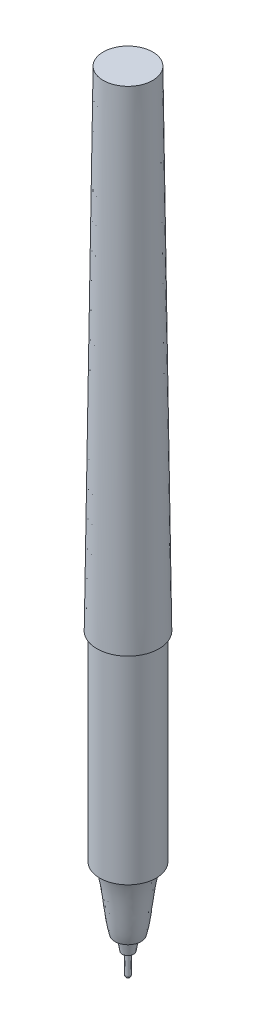
ISO-10303-21;
HEADER;
FILE_DESCRIPTION(('STEP AP214'),'2;1');
FILE_NAME('part.step','',(''),(''),'','','');
FILE_SCHEMA(('AUTOMOTIVE_DESIGN { 1 0 10303 214 1 1 1 1 }'));
ENDSEC;
DATA;
#1=APPLICATION_CONTEXT('core data for automotive mechanical design processes');
#2=APPLICATION_PROTOCOL_DEFINITION('international standard','automotive_design',2000,#1);
#3=PRODUCT_CONTEXT('',#1,'mechanical');
#4=PRODUCT('Part','Part','',(#3));
#5=PRODUCT_RELATED_PRODUCT_CATEGORY('part','',(#4));
#6=PRODUCT_DEFINITION_FORMATION('','',#4);
#7=PRODUCT_DEFINITION_CONTEXT('part definition',#1,'design');
#8=PRODUCT_DEFINITION('design','',#6,#7);
#9=PRODUCT_DEFINITION_SHAPE('','',#8);
#10=(LENGTH_UNIT() NAMED_UNIT(*) SI_UNIT(.MILLI.,.METRE.));
#11=(NAMED_UNIT(*) PLANE_ANGLE_UNIT() SI_UNIT($,.RADIAN.));
#12=(NAMED_UNIT(*) SI_UNIT($,.STERADIAN.) SOLID_ANGLE_UNIT());
#13=UNCERTAINTY_MEASURE_WITH_UNIT(LENGTH_MEASURE(1.E-05),#10,'distance_accuracy_value','');
#14=(GEOMETRIC_REPRESENTATION_CONTEXT(3) GLOBAL_UNCERTAINTY_ASSIGNED_CONTEXT((#13)) GLOBAL_UNIT_ASSIGNED_CONTEXT((#10,
#11,#12)) REPRESENTATION_CONTEXT('',''));
#15=CARTESIAN_POINT('',(0.,0.,0.));
#16=DIRECTION('',(0.,0.,1.));
#17=DIRECTION('',(1.,0.,0.));
#18=AXIS2_PLACEMENT_3D('',#15,#16,#17);
#19=CARTESIAN_POINT('',(0.,0.,0.));
#20=DIRECTION('',(0.,1.,0.));
#21=DIRECTION('',(0.,0.,1.));
#22=AXIS2_PLACEMENT_3D('',#19,#20,#21);
#23=PLANE('',#22);
#24=CARTESIAN_POINT('',(0.,0.,0.));
#25=DIRECTION('',(0.,1.,0.));
#26=DIRECTION('',(0.,0.,1.));
#27=AXIS2_PLACEMENT_3D('',#24,#25,#26);
#28=CIRCLE('',#27,4.9911);
#29=CARTESIAN_POINT('',(0.,0.,4.9911));
#30=VERTEX_POINT('',#29);
#31=EDGE_CURVE('E84',#30,#30,#28,.T.);
#32=ORIENTED_EDGE('',*,*,#31,.F.);
#33=EDGE_LOOP('',(#32));
#34=FACE_BOUND('',#33,.T.);
#35=CARTESIAN_POINT('',(0.,0.,0.));
#36=DIRECTION('',(0.,1.,0.));
#37=DIRECTION('',(0.,0.,1.));
#38=AXIS2_PLACEMENT_3D('',#35,#36,#37);
#39=CIRCLE('',#38,4.5466);
#40=CARTESIAN_POINT('',(0.,0.,4.5466));
#41=VERTEX_POINT('',#40);
#42=EDGE_CURVE('E92',#41,#41,#39,.F.);
#43=ORIENTED_EDGE('',*,*,#42,.F.);
#44=EDGE_LOOP('',(#43));
#45=FACE_BOUND('',#44,.T.);
#46=ADVANCED_FACE('F36',(#34,#45),#23,.F.);
#47=CARTESIAN_POINT('',(0.,78.74,0.));
#48=DIRECTION('',(0.,1.,0.));
#49=DIRECTION('',(0.,0.,1.));
#50=AXIS2_PLACEMENT_3D('',#47,#48,#49);
#51=PLANE('',#50);
#52=CARTESIAN_POINT('',(0.,78.74,0.));
#53=DIRECTION('',(0.,1.,0.));
#54=DIRECTION('',(0.,0.,1.));
#55=AXIS2_PLACEMENT_3D('',#52,#53,#54);
#56=CIRCLE('',#55,3.97824914067257);
#57=CARTESIAN_POINT('',(0.,78.74,3.97824914067257));
#58=VERTEX_POINT('',#57);
#59=EDGE_CURVE('E93',#58,#58,#56,.T.);
#60=ORIENTED_EDGE('',*,*,#59,.T.);
#61=EDGE_LOOP('',(#60));
#62=FACE_BOUND('',#61,.T.);
#63=ADVANCED_FACE('F38',(#62),#51,.T.);
#64=CARTESIAN_POINT('',(0.,78.74,0.));
#65=DIRECTION('',(0.,-1.,0.));
#66=DIRECTION('',(0.,0.,-1.));
#67=AXIS2_PLACEMENT_3D('',#64,#65,#66);
#68=CONICAL_SURFACE('',#67,3.97824914067257,0.0128625222485467);
#69=ORIENTED_EDGE('',*,*,#31,.T.);
#70=EDGE_LOOP('',(#69));
#71=FACE_BOUND('',#70,.T.);
#72=ORIENTED_EDGE('',*,*,#59,.F.);
#73=EDGE_LOOP('',(#72));
#74=FACE_BOUND('',#73,.T.);
#75=ADVANCED_FACE('F69',(#71,#74),#68,.T.);
#76=CARTESIAN_POINT('',(0.,-32.1945,0.));
#77=DIRECTION('',(0.,1.,0.));
#78=DIRECTION('',(0.,0.,1.));
#79=AXIS2_PLACEMENT_3D('',#76,#77,#78);
#80=CYLINDRICAL_SURFACE('',#79,4.5466);
#81=CARTESIAN_POINT('',(0.,-32.1945,0.));
#82=DIRECTION('',(0.,-1.,0.));
#83=DIRECTION('',(0.,0.,-1.));
#84=AXIS2_PLACEMENT_3D('',#81,#82,#83);
#85=CIRCLE('',#84,4.5466);
#86=CARTESIAN_POINT('',(0.,-32.1945,-4.5466));
#87=VERTEX_POINT('',#86);
#88=EDGE_CURVE('E108',#87,#87,#85,.T.);
#89=ORIENTED_EDGE('',*,*,#88,.F.);
#90=EDGE_LOOP('',(#89));
#91=FACE_BOUND('',#90,.T.);
#92=ORIENTED_EDGE('',*,*,#42,.T.);
#93=EDGE_LOOP('',(#92));
#94=FACE_BOUND('',#93,.T.);
#95=ADVANCED_FACE('F75',(#91,#94),#80,.T.);
#96=CARTESIAN_POINT('',(0.,-32.1945,0.));
#97=DIRECTION('',(0.,-1.,0.));
#98=DIRECTION('',(0.,0.,-1.));
#99=AXIS2_PLACEMENT_3D('',#96,#97,#98);
#100=PLANE('',#99);
#101=CARTESIAN_POINT('',(0.,-32.1945,-1.12406495963386E-13));
#102=DIRECTION('',(0.,-1.,0.));
#103=DIRECTION('',(0.,0.,-1.));
#104=AXIS2_PLACEMENT_3D('',#101,#102,#103);
#105=CIRCLE('',#104,3.8608);
#106=CARTESIAN_POINT('',(0.,-32.1945,-3.86080000000011));
#107=VERTEX_POINT('',#106);
#108=EDGE_CURVE('E113',#107,#107,#105,.T.);
#109=ORIENTED_EDGE('',*,*,#108,.F.);
#110=EDGE_LOOP('',(#109));
#111=FACE_BOUND('',#110,.T.);
#112=ORIENTED_EDGE('',*,*,#88,.T.);
#113=EDGE_LOOP('',(#112));
#114=FACE_BOUND('',#113,.T.);
#115=ADVANCED_FACE('F123',(#111,#114),#100,.T.);
#116=CARTESIAN_POINT('',(0.,-42.2782999999962,0.));
#117=DIRECTION('',(0.,-1.,0.));
#118=DIRECTION('',(0.,0.,-1.));
#119=AXIS2_PLACEMENT_3D('',#116,#117,#118);
#120=PLANE('',#119);
#121=CARTESIAN_POINT('',(0.,-42.2782999999962,-1.47613895487999E-13));
#122=DIRECTION('',(0.,-1.,0.));
#123=DIRECTION('',(0.,0.,-1.));
#124=AXIS2_PLACEMENT_3D('',#121,#122,#123);
#125=CIRCLE('',#124,1.31445000000063);
#126=CARTESIAN_POINT('',(0.,-42.2782999999962,-1.31445000000078));
#127=VERTEX_POINT('',#126);
#128=EDGE_CURVE('E44',#127,#127,#125,.T.);
#129=ORIENTED_EDGE('',*,*,#128,.F.);
#130=EDGE_LOOP('',(#129));
#131=FACE_BOUND('',#130,.T.);
#132=CARTESIAN_POINT('',(0.,-42.2783,-1.47613895488012E-13));
#133=DIRECTION('',(0.,-1.,0.));
#134=DIRECTION('',(0.,0.,-1.));
#135=AXIS2_PLACEMENT_3D('',#132,#133,#134);
#136=CIRCLE('',#135,2.10185);
#137=CARTESIAN_POINT('',(0.,-42.2783,-2.10185000000014));
#138=VERTEX_POINT('',#137);
#139=EDGE_CURVE('E127',#138,#138,#136,.T.);
#140=ORIENTED_EDGE('',*,*,#139,.T.);
#141=EDGE_LOOP('',(#140));
#142=FACE_BOUND('',#141,.T.);
#143=ADVANCED_FACE('F119',(#131,#142),#120,.T.);
#144=CARTESIAN_POINT('',(2.10185,-42.2783,0.));
#145=CARTESIAN_POINT('',(2.81252168910501,-39.8411733500328,0.));
#146=CARTESIAN_POINT('',(2.87053762692874,-34.9718667689138,0.));
#147=CARTESIAN_POINT('',(3.8608,-32.1945,0.));
#148=B_SPLINE_CURVE_WITH_KNOTS('',3,(#144,#145,#146,#147),.UNSPECIFIED.,.F.,.F.,(4,4),(0.,1.),.UNSPECIFIED.);
#149=CARTESIAN_POINT('',(0.,-1000.,-3.49148133884313E-12));
#150=DIRECTION('',(0.,-1.,0.));
#151=AXIS1_PLACEMENT('',#149,#150);
#152=SURFACE_OF_REVOLUTION('',#148,#151);
#153=ORIENTED_EDGE('',*,*,#108,.T.);
#154=EDGE_LOOP('',(#153));
#155=FACE_BOUND('',#154,.T.);
#156=ORIENTED_EDGE('',*,*,#139,.F.);
#157=EDGE_LOOP('',(#156));
#158=FACE_BOUND('',#157,.T.);
#159=ADVANCED_FACE('F122',(#155,#158),#152,.F.);
#160=CARTESIAN_POINT('',(0.92075,-44.6278000000003,0.));
#161=DIRECTION('',(0.,-1.,0.));
#162=DIRECTION('',(0.,0.,-1.));
#163=AXIS2_PLACEMENT_3D('',#160,#161,#162);
#164=PLANE('',#163);
#165=CARTESIAN_POINT('',(0.,-44.6278000000003,-1.55817130893625E-13));
#166=DIRECTION('',(0.,-1.,0.));
#167=DIRECTION('',(0.,0.,-1.));
#168=AXIS2_PLACEMENT_3D('',#165,#166,#167);
#169=CIRCLE('',#168,0.40005);
#170=CARTESIAN_POINT('',(0.,-44.6278000000003,-0.400050000000156));
#171=VERTEX_POINT('',#170);
#172=EDGE_CURVE('E12',#171,#171,#169,.T.);
#173=ORIENTED_EDGE('',*,*,#172,.F.);
#174=EDGE_LOOP('',(#173));
#175=FACE_BOUND('',#174,.T.);
#176=CARTESIAN_POINT('',(0.,-44.6278,-1.55817130893624E-13));
#177=DIRECTION('',(0.,-1.,0.));
#178=DIRECTION('',(0.,0.,-1.));
#179=AXIS2_PLACEMENT_3D('',#176,#177,#178);
#180=CIRCLE('',#179,0.92075);
#181=CARTESIAN_POINT('',(0.,-44.6278,-0.920750000000156));
#182=VERTEX_POINT('',#181);
#183=EDGE_CURVE('E129',#182,#182,#180,.T.);
#184=ORIENTED_EDGE('',*,*,#183,.T.);
#185=EDGE_LOOP('',(#184));
#186=FACE_BOUND('',#185,.T.);
#187=ADVANCED_FACE('F59',(#175,#186),#164,.T.);
#188=CARTESIAN_POINT('',(0.,-44.6278,-1.55817130893624E-13));
#189=DIRECTION('',(0.,1.,0.));
#190=DIRECTION('',(0.,0.,1.));
#191=AXIS2_PLACEMENT_3D('',#188,#189,#190);
#192=CONICAL_SURFACE('',#191,0.92075,0.166025101379535);
#193=ORIENTED_EDGE('',*,*,#128,.T.);
#194=EDGE_LOOP('',(#193));
#195=FACE_BOUND('',#194,.T.);
#196=ORIENTED_EDGE('',*,*,#183,.F.);
#197=EDGE_LOOP('',(#196));
#198=FACE_BOUND('',#197,.T.);
#199=ADVANCED_FACE('F50',(#195,#198),#192,.T.);
#200=CARTESIAN_POINT('',(0.,-47.904449612404,0.00634999999983238));
#201=DIRECTION('',(-1.,0.,0.));
#202=DIRECTION('',(0.,0.,-1.));
#203=AXIS2_PLACEMENT_3D('',#200,#201,#202);
#204=CIRCLE('',#203,0.406399999999999);
#205=TRIMMED_CURVE('',#204,(PARAMETER_VALUE(-1.55517069094216)),
(PARAMETER_VALUE(1.55517069094216)),.T.,.PARAMETER.);
#206=CARTESIAN_POINT('',(0.,-47.904449612404,-1.6725749186926E-13));
#207=DIRECTION('',(0.,-1.,0.));
#208=AXIS1_PLACEMENT('',#206,#207);
#209=SURFACE_OF_REVOLUTION('',#205,#208);
#210=CARTESIAN_POINT('',(0.,-47.9044496124039,-1.6725749186926E-13));
#211=DIRECTION('',(0.,-1.,0.));
#212=DIRECTION('',(0.,0.,-1.));
#213=AXIS2_PLACEMENT_3D('',#210,#211,#212);
#214=CIRCLE('',#213,0.40005);
#215=CARTESIAN_POINT('',(0.,-47.9044496124039,-0.400050000000168));
#216=VERTEX_POINT('',#215);
#217=EDGE_CURVE('E134',#216,#216,#214,.T.);
#218=ORIENTED_EDGE('',*,*,#217,.T.);
#219=EDGE_LOOP('',(#218));
#220=FACE_BOUND('',#219,.T.);
#221=CARTESIAN_POINT('',(0.,-48.3108000000007,0.));
#222=VERTEX_POINT('',#221);
#223=VERTEX_LOOP('',#222);
#224=FACE_BOUND('',#223,.T.);
#225=ADVANCED_FACE('F47',(#220,#224),#209,.T.);
#226=CARTESIAN_POINT('',(0.,-1000.,-3.49148133884313E-12));
#227=DIRECTION('',(0.,-1.,0.));
#228=DIRECTION('',(0.,0.,-1.));
#229=AXIS2_PLACEMENT_3D('',#226,#227,#228);
#230=CYLINDRICAL_SURFACE('',#229,0.40005);
#231=ORIENTED_EDGE('',*,*,#172,.T.);
#232=EDGE_LOOP('',(#231));
#233=FACE_BOUND('',#232,.T.);
#234=ORIENTED_EDGE('',*,*,#217,.F.);
#235=EDGE_LOOP('',(#234));
#236=FACE_BOUND('',#235,.T.);
#237=ADVANCED_FACE('F49',(#233,#236),#230,.T.);
#238=CLOSED_SHELL('',(#46,#63,#75,#95,#115,#143,#159,#187,#199,#225,#237));
#239=MANIFOLD_SOLID_BREP('B2',#238);
#240=ADVANCED_BREP_SHAPE_REPRESENTATION('',(#18,#239),#14);
#241=SHAPE_DEFINITION_REPRESENTATION(#9,#240);
ENDSEC;
END-ISO-10303-21;
